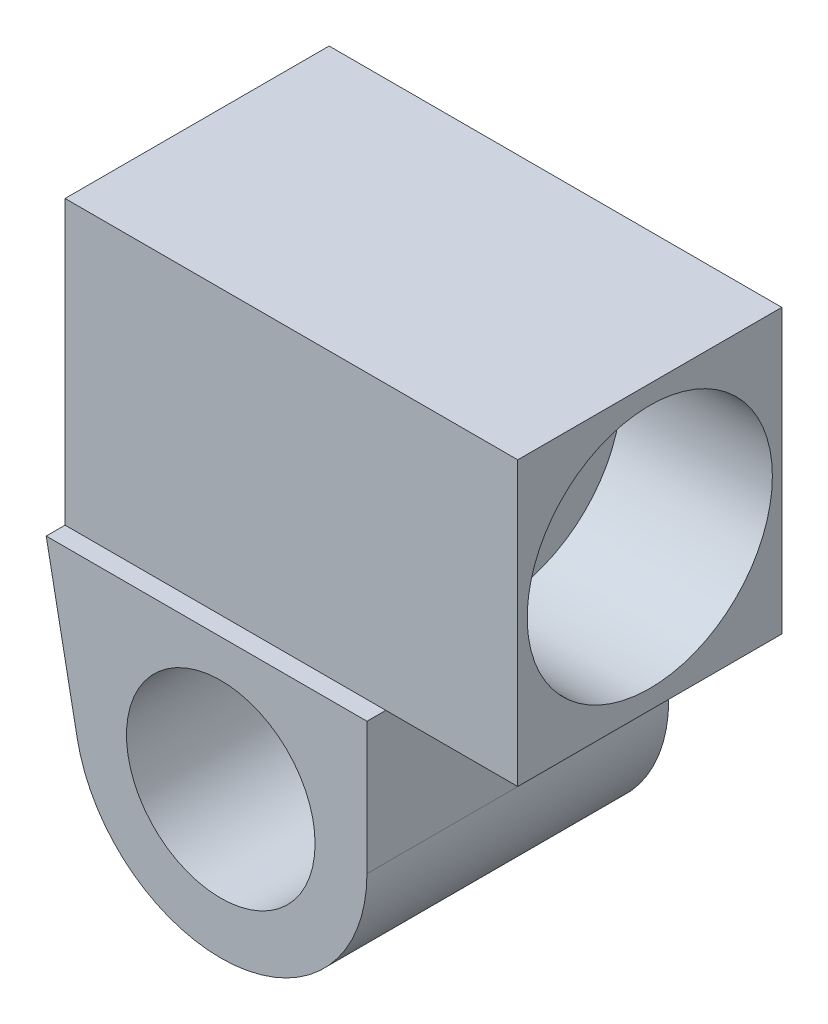
ISO-10303-21;
HEADER;
FILE_DESCRIPTION(('STEP AP214'),'2;1');
FILE_NAME('part.step','',(''),(''),'','','');
FILE_SCHEMA(('AUTOMOTIVE_DESIGN { 1 0 10303 214 1 1 1 1 }'));
ENDSEC;
DATA;
#1=APPLICATION_CONTEXT('core data for automotive mechanical design processes');
#2=APPLICATION_PROTOCOL_DEFINITION('international standard','automotive_design',2000,#1);
#3=PRODUCT_CONTEXT('',#1,'mechanical');
#4=PRODUCT('Part','Part','',(#3));
#5=PRODUCT_RELATED_PRODUCT_CATEGORY('part','',(#4));
#6=PRODUCT_DEFINITION_FORMATION('','',#4);
#7=PRODUCT_DEFINITION_CONTEXT('part definition',#1,'design');
#8=PRODUCT_DEFINITION('design','',#6,#7);
#9=PRODUCT_DEFINITION_SHAPE('','',#8);
#10=(LENGTH_UNIT() NAMED_UNIT(*) SI_UNIT(.MILLI.,.METRE.));
#11=(NAMED_UNIT(*) PLANE_ANGLE_UNIT() SI_UNIT($,.RADIAN.));
#12=(NAMED_UNIT(*) SI_UNIT($,.STERADIAN.) SOLID_ANGLE_UNIT());
#13=UNCERTAINTY_MEASURE_WITH_UNIT(LENGTH_MEASURE(1.E-05),#10,'distance_accuracy_value','');
#14=(GEOMETRIC_REPRESENTATION_CONTEXT(3) GLOBAL_UNCERTAINTY_ASSIGNED_CONTEXT((#13)) GLOBAL_UNIT_ASSIGNED_CONTEXT((#10,
#11,#12)) REPRESENTATION_CONTEXT('',''));
#15=CARTESIAN_POINT('',(0.,0.,0.));
#16=DIRECTION('',(0.,0.,1.));
#17=DIRECTION('',(1.,0.,0.));
#18=AXIS2_PLACEMENT_3D('',#15,#16,#17);
#19=CARTESIAN_POINT('',(240.,75.,-70.));
#20=DIRECTION('',(1.,0.,0.));
#21=DIRECTION('',(0.,0.,-1.));
#22=AXIS2_PLACEMENT_3D('',#19,#20,#21);
#23=PLANE('',#22);
#24=CARTESIAN_POINT('',(240.,0.,0.));
#25=DIRECTION('',(1.,0.,0.));
#26=DIRECTION('',(0.,0.,-1.));
#27=AXIS2_PLACEMENT_3D('',#24,#25,#26);
#28=CIRCLE('',#27,65.);
#29=CARTESIAN_POINT('',(240.,0.,-65.));
#30=VERTEX_POINT('',#29);
#31=EDGE_CURVE('E211',#30,#30,#28,.T.);
#32=ORIENTED_EDGE('',*,*,#31,.F.);
#33=EDGE_LOOP('',(#32));
#34=FACE_BOUND('',#33,.T.);
#35=DIRECTION('',(0.,1.,0.));
#36=VECTOR('',#35,1.);
#37=CARTESIAN_POINT('',(240.,75.,-70.));
#38=LINE('',#37,#36);
#39=CARTESIAN_POINT('',(240.,-75.,-70.));
#40=VERTEX_POINT('',#39);
#41=CARTESIAN_POINT('',(240.,75.,-70.));
#42=VERTEX_POINT('',#41);
#43=EDGE_CURVE('E149',#40,#42,#38,.T.);
#44=ORIENTED_EDGE('',*,*,#43,.T.);
#45=DIRECTION('',(0.,0.,1.));
#46=VECTOR('',#45,1.);
#47=CARTESIAN_POINT('',(240.,75.,70.));
#48=LINE('',#47,#46);
#49=CARTESIAN_POINT('',(240.,75.,70.));
#50=VERTEX_POINT('',#49);
#51=EDGE_CURVE('E167',#42,#50,#48,.T.);
#52=ORIENTED_EDGE('',*,*,#51,.T.);
#53=DIRECTION('',(0.,-1.,0.));
#54=VECTOR('',#53,1.);
#55=CARTESIAN_POINT('',(240.,75.,70.));
#56=LINE('',#55,#54);
#57=CARTESIAN_POINT('',(240.,-75.,70.));
#58=VERTEX_POINT('',#57);
#59=EDGE_CURVE('E165',#50,#58,#56,.T.);
#60=ORIENTED_EDGE('',*,*,#59,.T.);
#61=DIRECTION('',(0.,0.,-1.));
#62=VECTOR('',#61,1.);
#63=CARTESIAN_POINT('',(240.,-75.,70.));
#64=LINE('',#63,#62);
#65=EDGE_CURVE('E133',#58,#40,#64,.T.);
#66=ORIENTED_EDGE('',*,*,#65,.T.);
#67=EDGE_LOOP('',(#44,#52,#60,#66));
#68=FACE_BOUND('',#67,.T.);
#69=ADVANCED_FACE('F40',(#34,#68),#23,.T.);
#70=CARTESIAN_POINT('',(240.,75.,-70.));
#71=DIRECTION('',(0.,0.,1.));
#72=DIRECTION('',(0.,-1.,0.));
#73=AXIS2_PLACEMENT_3D('',#70,#71,#72);
#74=PLANE('',#73);
#75=DIRECTION('',(0.,1.,0.));
#76=VECTOR('',#75,1.);
#77=CARTESIAN_POINT('',(0.,75.,-70.));
#78=LINE('',#77,#76);
#79=CARTESIAN_POINT('',(0.,-75.,-70.));
#80=VERTEX_POINT('',#79);
#81=CARTESIAN_POINT('',(0.,75.,-70.));
#82=VERTEX_POINT('',#81);
#83=EDGE_CURVE('E161',#80,#82,#78,.T.);
#84=ORIENTED_EDGE('',*,*,#83,.T.);
#85=DIRECTION('',(-1.,0.,0.));
#86=VECTOR('',#85,1.);
#87=CARTESIAN_POINT('',(240.,75.,-70.));
#88=LINE('',#87,#86);
#89=EDGE_CURVE('E144',#42,#82,#88,.T.);
#90=ORIENTED_EDGE('',*,*,#89,.F.);
#91=ORIENTED_EDGE('',*,*,#43,.F.);
#92=DIRECTION('',(-1.,0.,0.));
#93=VECTOR('',#92,1.);
#94=CARTESIAN_POINT('',(240.,-75.,-70.));
#95=LINE('',#94,#93);
#96=CARTESIAN_POINT('',(170.057165498669,-75.,-70.));
#97=VERTEX_POINT('',#96);
#98=EDGE_CURVE('E134',#40,#97,#95,.T.);
#99=ORIENTED_EDGE('',*,*,#98,.T.);
#100=EDGE_CURVE('E127',#97,#80,#95,.T.);
#101=ORIENTED_EDGE('',*,*,#100,.T.);
#102=EDGE_LOOP('',(#84,#90,#91,#99,#101));
#103=FACE_BOUND('',#102,.T.);
#104=ADVANCED_FACE('F146',(#103),#74,.F.);
#105=CARTESIAN_POINT('',(240.,75.,70.));
#106=DIRECTION('',(0.,-1.,0.));
#107=DIRECTION('',(0.,0.,-1.));
#108=AXIS2_PLACEMENT_3D('',#105,#106,#107);
#109=PLANE('',#108);
#110=DIRECTION('',(0.,0.,1.));
#111=VECTOR('',#110,1.);
#112=CARTESIAN_POINT('',(0.,75.,70.));
#113=LINE('',#112,#111);
#114=CARTESIAN_POINT('',(0.,75.,70.));
#115=VERTEX_POINT('',#114);
#116=EDGE_CURVE('E159',#82,#115,#113,.T.);
#117=ORIENTED_EDGE('',*,*,#116,.T.);
#118=DIRECTION('',(-1.,0.,0.));
#119=VECTOR('',#118,1.);
#120=CARTESIAN_POINT('',(240.,75.,70.));
#121=LINE('',#120,#119);
#122=EDGE_CURVE('E204',#50,#115,#121,.T.);
#123=ORIENTED_EDGE('',*,*,#122,.F.);
#124=ORIENTED_EDGE('',*,*,#51,.F.);
#125=ORIENTED_EDGE('',*,*,#89,.T.);
#126=EDGE_LOOP('',(#117,#123,#124,#125));
#127=FACE_BOUND('',#126,.T.);
#128=ADVANCED_FACE('F228',(#127),#109,.F.);
#129=CARTESIAN_POINT('',(240.,75.,70.));
#130=DIRECTION('',(0.,0.,-1.));
#131=DIRECTION('',(0.,1.,0.));
#132=AXIS2_PLACEMENT_3D('',#129,#130,#131);
#133=PLANE('',#132);
#134=DIRECTION('',(0.,-1.,0.));
#135=VECTOR('',#134,1.);
#136=CARTESIAN_POINT('',(0.,75.,70.));
#137=LINE('',#136,#135);
#138=CARTESIAN_POINT('',(0.,-75.,70.));
#139=VERTEX_POINT('',#138);
#140=EDGE_CURVE('E156',#115,#139,#137,.T.);
#141=ORIENTED_EDGE('',*,*,#140,.T.);
#142=DIRECTION('',(-1.,0.,0.));
#143=VECTOR('',#142,1.);
#144=CARTESIAN_POINT('',(240.,-75.,70.));
#145=LINE('',#144,#143);
#146=CARTESIAN_POINT('',(170.057165498669,-75.,70.));
#147=VERTEX_POINT('',#146);
#148=EDGE_CURVE('E150',#147,#139,#145,.T.);
#149=ORIENTED_EDGE('',*,*,#148,.F.);
#150=EDGE_CURVE('E143',#58,#147,#145,.T.);
#151=ORIENTED_EDGE('',*,*,#150,.F.);
#152=ORIENTED_EDGE('',*,*,#59,.F.);
#153=ORIENTED_EDGE('',*,*,#122,.T.);
#154=EDGE_LOOP('',(#141,#149,#151,#152,#153));
#155=FACE_BOUND('',#154,.T.);
#156=ADVANCED_FACE('F201',(#155),#133,.F.);
#157=CARTESIAN_POINT('',(240.,-75.,70.));
#158=DIRECTION('',(0.,1.,0.));
#159=DIRECTION('',(0.,0.,1.));
#160=AXIS2_PLACEMENT_3D('',#157,#158,#159);
#161=PLANE('',#160);
#162=ORIENTED_EDGE('',*,*,#150,.T.);
#163=DIRECTION('',(0.,0.,-1.));
#164=VECTOR('',#163,1.);
#165=CARTESIAN_POINT('',(170.057165498669,-75.,80.));
#166=LINE('',#165,#164);
#167=EDGE_CURVE('E117',#147,#97,#166,.T.);
#168=ORIENTED_EDGE('',*,*,#167,.T.);
#169=ORIENTED_EDGE('',*,*,#98,.F.);
#170=ORIENTED_EDGE('',*,*,#65,.F.);
#171=EDGE_LOOP('',(#162,#168,#169,#170));
#172=FACE_BOUND('',#171,.T.);
#173=ADVANCED_FACE('F139',(#172),#161,.F.);
#174=CARTESIAN_POINT('',(0.,0.,0.));
#175=DIRECTION('',(1.,0.,0.));
#176=DIRECTION('',(0.,0.,-1.));
#177=AXIS2_PLACEMENT_3D('',#174,#175,#176);
#178=PLANE('',#177);
#179=ORIENTED_EDGE('',*,*,#83,.F.);
#180=DIRECTION('',(0.,0.,-1.));
#181=VECTOR('',#180,1.);
#182=CARTESIAN_POINT('',(0.,-75.,70.));
#183=LINE('',#182,#181);
#184=EDGE_CURVE('E154',#139,#80,#183,.T.);
#185=ORIENTED_EDGE('',*,*,#184,.F.);
#186=ORIENTED_EDGE('',*,*,#140,.F.);
#187=ORIENTED_EDGE('',*,*,#116,.F.);
#188=EDGE_LOOP('',(#179,#185,#186,#187));
#189=FACE_BOUND('',#188,.T.);
#190=ADVANCED_FACE('F206',(#189),#178,.F.);
#191=CARTESIAN_POINT('',(0.,-75.,80.));
#192=DIRECTION('',(0.,-1.,0.));
#193=DIRECTION('',(0.,0.,-1.));
#194=AXIS2_PLACEMENT_3D('',#191,#192,#193);
#195=PLANE('',#194);
#196=CARTESIAN_POINT('',(170.057165498669,-75.,80.));
#197=VERTEX_POINT('',#196);
#198=EDGE_CURVE('E124',#197,#147,#166,.T.);
#199=ORIENTED_EDGE('',*,*,#198,.T.);
#200=ORIENTED_EDGE('',*,*,#148,.T.);
#201=DIRECTION('',(0.,0.,-1.));
#202=VECTOR('',#201,1.);
#203=CARTESIAN_POINT('',(0.,-75.,80.));
#204=LINE('',#203,#202);
#205=CARTESIAN_POINT('',(0.,-75.,80.));
#206=VERTEX_POINT('',#205);
#207=EDGE_CURVE('E163',#206,#139,#204,.T.);
#208=ORIENTED_EDGE('',*,*,#207,.F.);
#209=DIRECTION('',(-1.,0.,0.));
#210=VECTOR('',#209,1.);
#211=CARTESIAN_POINT('',(0.,-75.,80.));
#212=LINE('',#211,#210);
#213=EDGE_CURVE('E178',#197,#206,#212,.T.);
#214=ORIENTED_EDGE('',*,*,#213,.F.);
#215=EDGE_LOOP('',(#199,#200,#208,#214));
#216=FACE_BOUND('',#215,.T.);
#217=ADVANCED_FACE('F194',(#216),#195,.F.);
#218=CARTESIAN_POINT('',(92.5571654986695,-145.,80.));
#219=DIRECTION('',(0.,0.,1.));
#220=DIRECTION('',(1.,0.,0.));
#221=AXIS2_PLACEMENT_3D('',#218,#219,#220);
#222=PLANE('',#221);
#223=ORIENTED_EDGE('',*,*,#213,.T.);
#224=DIRECTION('',(0.190808995376545,-0.981627183447664,0.));
#225=VECTOR('',#224,1.);
#226=CARTESIAN_POINT('',(0.,-75.,80.));
#227=LINE('',#226,#225);
#228=CARTESIAN_POINT('',(16.4810587814755,-159.787697141682,80.));
#229=VERTEX_POINT('',#228);
#230=EDGE_CURVE('E73',#206,#229,#227,.T.);
#231=ORIENTED_EDGE('',*,*,#230,.T.);
#232=CARTESIAN_POINT('',(92.5571654986695,-145.,80.));
#233=DIRECTION('',(0.,0.,1.));
#234=DIRECTION('',(1.,0.,0.));
#235=AXIS2_PLACEMENT_3D('',#232,#233,#234);
#236=CIRCLE('',#235,77.5);
#237=CARTESIAN_POINT('',(170.057165498669,-145.,80.));
#238=VERTEX_POINT('',#237);
#239=EDGE_CURVE('E185',#229,#238,#236,.T.);
#240=ORIENTED_EDGE('',*,*,#239,.T.);
#241=DIRECTION('',(0.,1.,0.));
#242=VECTOR('',#241,1.);
#243=CARTESIAN_POINT('',(170.057165498669,-75.,80.));
#244=LINE('',#243,#242);
#245=EDGE_CURVE('E123',#238,#197,#244,.T.);
#246=ORIENTED_EDGE('',*,*,#245,.T.);
#247=EDGE_LOOP('',(#223,#231,#240,#246));
#248=FACE_BOUND('',#247,.T.);
#249=CARTESIAN_POINT('',(92.5571654986695,-145.,80.));
#250=DIRECTION('',(0.,0.,1.));
#251=DIRECTION('',(1.,0.,0.));
#252=AXIS2_PLACEMENT_3D('',#249,#250,#251);
#253=CIRCLE('',#252,50.);
#254=CARTESIAN_POINT('',(142.557165498669,-145.,80.));
#255=VERTEX_POINT('',#254);
#256=EDGE_CURVE('E43',#255,#255,#253,.T.);
#257=ORIENTED_EDGE('',*,*,#256,.F.);
#258=EDGE_LOOP('',(#257));
#259=FACE_BOUND('',#258,.T.);
#260=ADVANCED_FACE('F190',(#248,#259),#222,.T.);
#261=CARTESIAN_POINT('',(92.5571654986695,-145.,-80.));
#262=DIRECTION('',(0.,0.,1.));
#263=DIRECTION('',(1.,0.,0.));
#264=AXIS2_PLACEMENT_3D('',#261,#262,#263);
#265=PLANE('',#264);
#266=DIRECTION('',(-1.,0.,0.));
#267=VECTOR('',#266,1.);
#268=CARTESIAN_POINT('',(0.,-75.,-80.));
#269=LINE('',#268,#267);
#270=CARTESIAN_POINT('',(170.057165498669,-75.,-80.));
#271=VERTEX_POINT('',#270);
#272=CARTESIAN_POINT('',(0.,-75.,-80.));
#273=VERTEX_POINT('',#272);
#274=EDGE_CURVE('E182',#271,#273,#269,.T.);
#275=ORIENTED_EDGE('',*,*,#274,.F.);
#276=DIRECTION('',(0.,1.,0.));
#277=VECTOR('',#276,1.);
#278=CARTESIAN_POINT('',(170.057165498669,-75.,-80.));
#279=LINE('',#278,#277);
#280=CARTESIAN_POINT('',(170.057165498669,-145.,-80.));
#281=VERTEX_POINT('',#280);
#282=EDGE_CURVE('E121',#281,#271,#279,.T.);
#283=ORIENTED_EDGE('',*,*,#282,.F.);
#284=CARTESIAN_POINT('',(92.5571654986695,-145.,-80.));
#285=DIRECTION('',(0.,0.,1.));
#286=DIRECTION('',(1.,0.,0.));
#287=AXIS2_PLACEMENT_3D('',#284,#285,#286);
#288=CIRCLE('',#287,77.5);
#289=CARTESIAN_POINT('',(16.4810587814755,-159.787697141682,-80.));
#290=VERTEX_POINT('',#289);
#291=EDGE_CURVE('E177',#290,#281,#288,.T.);
#292=ORIENTED_EDGE('',*,*,#291,.F.);
#293=DIRECTION('',(0.190808995376545,-0.981627183447664,0.));
#294=VECTOR('',#293,1.);
#295=CARTESIAN_POINT('',(0.,-75.,-80.));
#296=LINE('',#295,#294);
#297=EDGE_CURVE('E180',#273,#290,#296,.T.);
#298=ORIENTED_EDGE('',*,*,#297,.F.);
#299=EDGE_LOOP('',(#275,#283,#292,#298));
#300=FACE_BOUND('',#299,.T.);
#301=CARTESIAN_POINT('',(92.5571654986695,-145.,-80.));
#302=DIRECTION('',(0.,0.,1.));
#303=DIRECTION('',(1.,0.,0.));
#304=AXIS2_PLACEMENT_3D('',#301,#302,#303);
#305=CIRCLE('',#304,50.);
#306=CARTESIAN_POINT('',(142.557165498669,-145.,-80.));
#307=VERTEX_POINT('',#306);
#308=EDGE_CURVE('E11',#307,#307,#305,.T.);
#309=ORIENTED_EDGE('',*,*,#308,.T.);
#310=EDGE_LOOP('',(#309));
#311=FACE_BOUND('',#310,.T.);
#312=ADVANCED_FACE('F244',(#300,#311),#265,.F.);
#313=ORIENTED_EDGE('',*,*,#100,.F.);
#314=EDGE_CURVE('E83',#97,#271,#166,.T.);
#315=ORIENTED_EDGE('',*,*,#314,.T.);
#316=ORIENTED_EDGE('',*,*,#274,.T.);
#317=EDGE_CURVE('E56',#80,#273,#204,.T.);
#318=ORIENTED_EDGE('',*,*,#317,.F.);
#319=EDGE_LOOP('',(#313,#315,#316,#318));
#320=FACE_BOUND('',#319,.T.);
#321=ADVANCED_FACE('F128',(#320),#195,.F.);
#322=CARTESIAN_POINT('',(0.,-75.,80.));
#323=DIRECTION('',(0.981627183447664,0.190808995376545,0.));
#324=DIRECTION('',(-0.190808995376545,0.981627183447664,0.));
#325=AXIS2_PLACEMENT_3D('',#322,#323,#324);
#326=PLANE('',#325);
#327=ORIENTED_EDGE('',*,*,#297,.T.);
#328=DIRECTION('',(0.,0.,-1.));
#329=VECTOR('',#328,1.);
#330=CARTESIAN_POINT('',(16.4810587814755,-159.787697141682,80.));
#331=LINE('',#330,#329);
#332=EDGE_CURVE('E171',#229,#290,#331,.T.);
#333=ORIENTED_EDGE('',*,*,#332,.F.);
#334=ORIENTED_EDGE('',*,*,#230,.F.);
#335=ORIENTED_EDGE('',*,*,#207,.T.);
#336=ORIENTED_EDGE('',*,*,#184,.T.);
#337=ORIENTED_EDGE('',*,*,#317,.T.);
#338=EDGE_LOOP('',(#327,#333,#334,#335,#336,#337));
#339=FACE_BOUND('',#338,.T.);
#340=ADVANCED_FACE('F196',(#339),#326,.F.);
#341=CARTESIAN_POINT('',(92.5571654986695,-145.,80.));
#342=DIRECTION('',(0.,0.,-1.));
#343=DIRECTION('',(-1.,0.,0.));
#344=AXIS2_PLACEMENT_3D('',#341,#342,#343);
#345=CYLINDRICAL_SURFACE('',#344,77.5);
#346=ORIENTED_EDGE('',*,*,#291,.T.);
#347=DIRECTION('',(0.,0.,-1.));
#348=VECTOR('',#347,1.);
#349=CARTESIAN_POINT('',(170.057165498669,-145.,80.));
#350=LINE('',#349,#348);
#351=EDGE_CURVE('E174',#238,#281,#350,.T.);
#352=ORIENTED_EDGE('',*,*,#351,.F.);
#353=ORIENTED_EDGE('',*,*,#239,.F.);
#354=ORIENTED_EDGE('',*,*,#332,.T.);
#355=EDGE_LOOP('',(#346,#352,#353,#354));
#356=FACE_BOUND('',#355,.T.);
#357=ADVANCED_FACE('F247',(#356),#345,.T.);
#358=CARTESIAN_POINT('',(170.057165498669,-75.,80.));
#359=DIRECTION('',(-1.,0.,0.));
#360=DIRECTION('',(0.,0.,1.));
#361=AXIS2_PLACEMENT_3D('',#358,#359,#360);
#362=PLANE('',#361);
#363=ORIENTED_EDGE('',*,*,#282,.T.);
#364=ORIENTED_EDGE('',*,*,#314,.F.);
#365=ORIENTED_EDGE('',*,*,#167,.F.);
#366=ORIENTED_EDGE('',*,*,#198,.F.);
#367=ORIENTED_EDGE('',*,*,#245,.F.);
#368=ORIENTED_EDGE('',*,*,#351,.T.);
#369=EDGE_LOOP('',(#363,#364,#365,#366,#367,#368));
#370=FACE_BOUND('',#369,.T.);
#371=ADVANCED_FACE('F114',(#370),#362,.F.);
#372=CARTESIAN_POINT('',(92.5571654986695,-145.,80.));
#373=DIRECTION('',(0.,0.,-1.));
#374=DIRECTION('',(-1.,0.,0.));
#375=AXIS2_PLACEMENT_3D('',#372,#373,#374);
#376=CYLINDRICAL_SURFACE('',#375,50.);
#377=ORIENTED_EDGE('',*,*,#256,.T.);
#378=EDGE_LOOP('',(#377));
#379=FACE_BOUND('',#378,.T.);
#380=ORIENTED_EDGE('',*,*,#308,.F.);
#381=EDGE_LOOP('',(#380));
#382=FACE_BOUND('',#381,.T.);
#383=ADVANCED_FACE('F222',(#379,#382),#376,.F.);
#384=CARTESIAN_POINT('',(160.,0.,0.));
#385=DIRECTION('',(1.,0.,0.));
#386=DIRECTION('',(0.,0.,-1.));
#387=AXIS2_PLACEMENT_3D('',#384,#385,#386);
#388=CYLINDRICAL_SURFACE('',#387,65.);
#389=CARTESIAN_POINT('',(160.,0.,0.));
#390=DIRECTION('',(1.,0.,0.));
#391=DIRECTION('',(0.,0.,-1.));
#392=AXIS2_PLACEMENT_3D('',#389,#390,#391);
#393=CIRCLE('',#392,65.);
#394=CARTESIAN_POINT('',(160.,0.,-65.));
#395=VERTEX_POINT('',#394);
#396=EDGE_CURVE('E145',#395,#395,#393,.T.);
#397=ORIENTED_EDGE('',*,*,#396,.F.);
#398=EDGE_LOOP('',(#397));
#399=FACE_BOUND('',#398,.T.);
#400=ORIENTED_EDGE('',*,*,#31,.T.);
#401=EDGE_LOOP('',(#400));
#402=FACE_BOUND('',#401,.T.);
#403=ADVANCED_FACE('F219',(#399,#402),#388,.F.);
#404=CARTESIAN_POINT('',(160.,0.,0.));
#405=DIRECTION('',(1.,0.,0.));
#406=DIRECTION('',(0.,0.,-1.));
#407=AXIS2_PLACEMENT_3D('',#404,#405,#406);
#408=PLANE('',#407);
#409=ORIENTED_EDGE('',*,*,#396,.T.);
#410=EDGE_LOOP('',(#409));
#411=FACE_BOUND('',#410,.T.);
#412=ADVANCED_FACE('F217',(#411),#408,.T.);
#413=CLOSED_SHELL('',(#69,#104,#128,#156,#173,#190,#217,#260,#312,#321,#340,#357,#371,#383,#403,#412));
#414=MANIFOLD_SOLID_BREP('B2',#413);
#415=ADVANCED_BREP_SHAPE_REPRESENTATION('',(#18,#414),#14);
#416=SHAPE_DEFINITION_REPRESENTATION(#9,#415);
ENDSEC;
END-ISO-10303-21;
